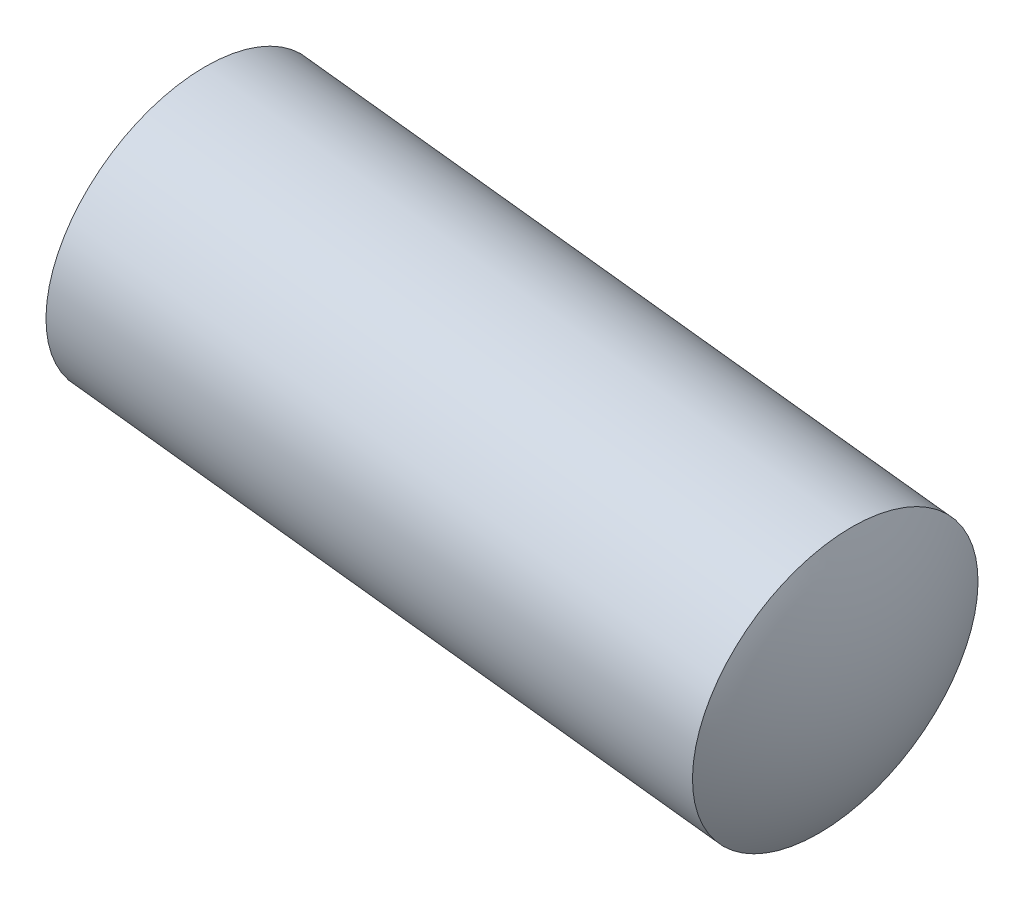
ISO-10303-21;
HEADER;
FILE_DESCRIPTION(('STEP AP214'),'2;1');
FILE_NAME('part.step','',(''),(''),'','','');
FILE_SCHEMA(('AUTOMOTIVE_DESIGN { 1 0 10303 214 1 1 1 1 }'));
ENDSEC;
DATA;
#1=APPLICATION_CONTEXT('core data for automotive mechanical design processes');
#2=APPLICATION_PROTOCOL_DEFINITION('international standard','automotive_design',2000,#1);
#3=PRODUCT_CONTEXT('',#1,'mechanical');
#4=PRODUCT('Part','Part','',(#3));
#5=PRODUCT_RELATED_PRODUCT_CATEGORY('part','',(#4));
#6=PRODUCT_DEFINITION_FORMATION('','',#4);
#7=PRODUCT_DEFINITION_CONTEXT('part definition',#1,'design');
#8=PRODUCT_DEFINITION('design','',#6,#7);
#9=PRODUCT_DEFINITION_SHAPE('','',#8);
#10=(LENGTH_UNIT() NAMED_UNIT(*) SI_UNIT(.MILLI.,.METRE.));
#11=(NAMED_UNIT(*) PLANE_ANGLE_UNIT() SI_UNIT($,.RADIAN.));
#12=(NAMED_UNIT(*) SI_UNIT($,.STERADIAN.) SOLID_ANGLE_UNIT());
#13=UNCERTAINTY_MEASURE_WITH_UNIT(LENGTH_MEASURE(1.E-05),#10,'distance_accuracy_value','');
#14=(GEOMETRIC_REPRESENTATION_CONTEXT(3) GLOBAL_UNCERTAINTY_ASSIGNED_CONTEXT((#13)) GLOBAL_UNIT_ASSIGNED_CONTEXT((#10,
#11,#12)) REPRESENTATION_CONTEXT('',''));
#15=CARTESIAN_POINT('',(0.,0.,0.));
#16=DIRECTION('',(0.,0.,1.));
#17=DIRECTION('',(1.,0.,0.));
#18=AXIS2_PLACEMENT_3D('',#15,#16,#17);
#19=CARTESIAN_POINT('',(-22.1624210154338,2.58743046257659,0.6));
#20=DIRECTION('',(0.115960935520541,0.993253774940323,0.));
#21=DIRECTION('',(-0.993253774940323,0.115960935520542,0.));
#22=AXIS2_PLACEMENT_3D('',#19,#20,#21);
#23=SPHERICAL_SURFACE('',#22,2.);
#24=CARTESIAN_POINT('',(-22.1624210154338,2.58743046257659,0.6));
#25=DIRECTION('',(0.993253774940323,-0.115960935520541,0.));
#26=DIRECTION('',(0.,0.,-1.));
#27=AXIS2_PLACEMENT_3D('',#24,#25,#26);
#28=SPHERICAL_SURFACE('',#27,2.);
#29=CARTESIAN_POINT('',(-23.88278701844,2.78828069459147,0.6));
#30=DIRECTION('',(0.993253774940323,-0.115960935520541,0.));
#31=DIRECTION('',(0.,0.,-1.));
#32=AXIS2_PLACEMENT_3D('',#29,#30,#31);
#33=CIRCLE('',#32,1.);
#34=CARTESIAN_POINT('',(-23.88278701844,2.78828069459147,-0.4));
#35=VERTEX_POINT('',#34);
#36=EDGE_CURVE('E10',#35,#35,#33,.T.);
#37=ORIENTED_EDGE('',*,*,#36,.F.);
#38=EDGE_LOOP('',(#37));
#39=FACE_BOUND('',#38,.T.);
#40=ADVANCED_FACE('F16',(#39),#28,.T.);
#41=CARTESIAN_POINT('',(-21.0441181944702,2.45687023256691,0.6));
#42=DIRECTION('',(0.115960935520541,0.993253774940323,0.));
#43=DIRECTION('',(0.993253774940323,-0.115960935520541,0.));
#44=AXIS2_PLACEMENT_3D('',#41,#42,#43);
#45=SPHERICAL_SURFACE('',#44,2.);
#46=CARTESIAN_POINT('',(-21.0441181944702,2.45687023256691,0.6));
#47=DIRECTION('',(0.993253774940323,-0.115960935520541,0.));
#48=DIRECTION('',(0.,0.,-1.));
#49=AXIS2_PLACEMENT_3D('',#46,#47,#48);
#50=SPHERICAL_SURFACE('',#49,2.);
#51=CARTESIAN_POINT('',(-19.323752191464,2.25602000055214,0.6));
#52=DIRECTION('',(0.993253774940323,-0.115960935520541,0.));
#53=DIRECTION('',(0.,0.,-1.));
#54=AXIS2_PLACEMENT_3D('',#51,#52,#53);
#55=CIRCLE('',#54,1.);
#56=CARTESIAN_POINT('',(-19.323752191464,2.25602000055214,-0.4));
#57=VERTEX_POINT('',#56);
#58=EDGE_CURVE('E26',#57,#57,#55,.T.);
#59=ORIENTED_EDGE('',*,*,#58,.T.);
#60=EDGE_LOOP('',(#59));
#61=FACE_BOUND('',#60,.T.);
#62=ADVANCED_FACE('F18',(#61),#50,.T.);
#63=CARTESIAN_POINT('',(-20.463510898208,2.389085174062,0.6));
#64=DIRECTION('',(0.993253774940323,-0.115960935520541,0.));
#65=DIRECTION('',(0.,0.,-1.));
#66=AXIS2_PLACEMENT_3D('',#63,#64,#65);
#67=CYLINDRICAL_SURFACE('',#66,1.);
#68=ORIENTED_EDGE('',*,*,#36,.T.);
#69=EDGE_LOOP('',(#68));
#70=FACE_BOUND('',#69,.T.);
#71=ORIENTED_EDGE('',*,*,#58,.F.);
#72=EDGE_LOOP('',(#71));
#73=FACE_BOUND('',#72,.T.);
#74=ADVANCED_FACE('F46',(#70,#73),#67,.T.);
#75=CLOSED_SHELL('',(#40,#62,#74));
#76=MANIFOLD_SOLID_BREP('B1',#75);
#77=ADVANCED_BREP_SHAPE_REPRESENTATION('',(#18,#76),#14);
#78=SHAPE_DEFINITION_REPRESENTATION(#9,#77);
ENDSEC;
END-ISO-10303-21;
